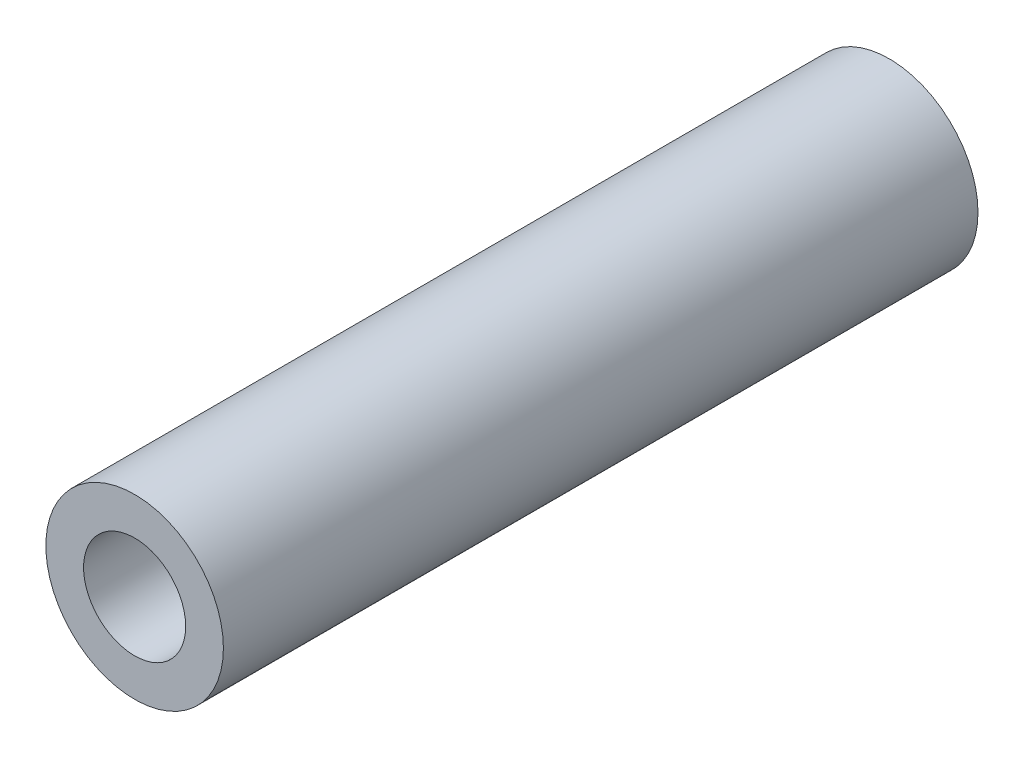
ISO-10303-21;
HEADER;
FILE_DESCRIPTION(('STEP AP214'),'2;1');
FILE_NAME('part.step','',(''),(''),'','','');
FILE_SCHEMA(('AUTOMOTIVE_DESIGN { 1 0 10303 214 1 1 1 1 }'));
ENDSEC;
DATA;
#1=APPLICATION_CONTEXT('core data for automotive mechanical design processes');
#2=APPLICATION_PROTOCOL_DEFINITION('international standard','automotive_design',2000,#1);
#3=PRODUCT_CONTEXT('',#1,'mechanical');
#4=PRODUCT('Part','Part','',(#3));
#5=PRODUCT_RELATED_PRODUCT_CATEGORY('part','',(#4));
#6=PRODUCT_DEFINITION_FORMATION('','',#4);
#7=PRODUCT_DEFINITION_CONTEXT('part definition',#1,'design');
#8=PRODUCT_DEFINITION('design','',#6,#7);
#9=PRODUCT_DEFINITION_SHAPE('','',#8);
#10=(LENGTH_UNIT() NAMED_UNIT(*) SI_UNIT(.MILLI.,.METRE.));
#11=(NAMED_UNIT(*) PLANE_ANGLE_UNIT() SI_UNIT($,.RADIAN.));
#12=(NAMED_UNIT(*) SI_UNIT($,.STERADIAN.) SOLID_ANGLE_UNIT());
#13=UNCERTAINTY_MEASURE_WITH_UNIT(LENGTH_MEASURE(1.E-05),#10,'distance_accuracy_value','');
#14=(GEOMETRIC_REPRESENTATION_CONTEXT(3) GLOBAL_UNCERTAINTY_ASSIGNED_CONTEXT((#13)) GLOBAL_UNIT_ASSIGNED_CONTEXT((#10,
#11,#12)) REPRESENTATION_CONTEXT('',''));
#15=CARTESIAN_POINT('',(0.,0.,0.));
#16=DIRECTION('',(0.,0.,1.));
#17=DIRECTION('',(1.,0.,0.));
#18=AXIS2_PLACEMENT_3D('',#15,#16,#17);
#19=CARTESIAN_POINT('',(0.,0.,17.));
#20=DIRECTION('',(0.,0.,1.));
#21=DIRECTION('',(1.,0.,0.));
#22=AXIS2_PLACEMENT_3D('',#19,#20,#21);
#23=PLANE('',#22);
#24=CARTESIAN_POINT('',(0.,0.,17.));
#25=DIRECTION('',(0.,0.,1.));
#26=DIRECTION('',(1.,0.,0.));
#27=AXIS2_PLACEMENT_3D('',#24,#25,#26);
#28=CIRCLE('',#27,4.);
#29=CARTESIAN_POINT('',(4.,0.,17.));
#30=VERTEX_POINT('',#29);
#31=EDGE_CURVE('E10',#30,#30,#28,.T.);
#32=ORIENTED_EDGE('',*,*,#31,.T.);
#33=EDGE_LOOP('',(#32));
#34=FACE_BOUND('',#33,.T.);
#35=CARTESIAN_POINT('',(0.,0.,17.));
#36=DIRECTION('',(0.,0.,1.));
#37=DIRECTION('',(1.,0.,0.));
#38=AXIS2_PLACEMENT_3D('',#35,#36,#37);
#39=CIRCLE('',#38,2.3);
#40=CARTESIAN_POINT('',(2.3,0.,17.));
#41=VERTEX_POINT('',#40);
#42=EDGE_CURVE('E41',#41,#41,#39,.T.);
#43=ORIENTED_EDGE('',*,*,#42,.F.);
#44=EDGE_LOOP('',(#43));
#45=FACE_BOUND('',#44,.T.);
#46=ADVANCED_FACE('F30',(#34,#45),#23,.T.);
#47=CARTESIAN_POINT('',(0.,0.,-17.));
#48=DIRECTION('',(0.,0.,1.));
#49=DIRECTION('',(1.,0.,0.));
#50=AXIS2_PLACEMENT_3D('',#47,#48,#49);
#51=PLANE('',#50);
#52=CARTESIAN_POINT('',(0.,0.,-17.));
#53=DIRECTION('',(0.,0.,1.));
#54=DIRECTION('',(1.,0.,0.));
#55=AXIS2_PLACEMENT_3D('',#52,#53,#54);
#56=CIRCLE('',#55,4.);
#57=CARTESIAN_POINT('',(4.,0.,-17.));
#58=VERTEX_POINT('',#57);
#59=EDGE_CURVE('E34',#58,#58,#56,.T.);
#60=ORIENTED_EDGE('',*,*,#59,.F.);
#61=EDGE_LOOP('',(#60));
#62=FACE_BOUND('',#61,.T.);
#63=CARTESIAN_POINT('',(0.,0.,-17.));
#64=DIRECTION('',(0.,0.,1.));
#65=DIRECTION('',(1.,0.,0.));
#66=AXIS2_PLACEMENT_3D('',#63,#64,#65);
#67=CIRCLE('',#66,2.3);
#68=CARTESIAN_POINT('',(2.3,0.,-17.));
#69=VERTEX_POINT('',#68);
#70=EDGE_CURVE('E43',#69,#69,#67,.T.);
#71=ORIENTED_EDGE('',*,*,#70,.T.);
#72=EDGE_LOOP('',(#71));
#73=FACE_BOUND('',#72,.T.);
#74=ADVANCED_FACE('F53',(#62,#73),#51,.F.);
#75=CARTESIAN_POINT('',(0.,0.,17.));
#76=DIRECTION('',(0.,0.,-1.));
#77=DIRECTION('',(-1.,0.,0.));
#78=AXIS2_PLACEMENT_3D('',#75,#76,#77);
#79=CYLINDRICAL_SURFACE('',#78,4.);
#80=ORIENTED_EDGE('',*,*,#31,.F.);
#81=EDGE_LOOP('',(#80));
#82=FACE_BOUND('',#81,.T.);
#83=ORIENTED_EDGE('',*,*,#59,.T.);
#84=EDGE_LOOP('',(#83));
#85=FACE_BOUND('',#84,.T.);
#86=ADVANCED_FACE('F32',(#82,#85),#79,.T.);
#87=CARTESIAN_POINT('',(0.,0.,17.));
#88=DIRECTION('',(0.,0.,-1.));
#89=DIRECTION('',(-1.,0.,0.));
#90=AXIS2_PLACEMENT_3D('',#87,#88,#89);
#91=CYLINDRICAL_SURFACE('',#90,2.3);
#92=ORIENTED_EDGE('',*,*,#42,.T.);
#93=EDGE_LOOP('',(#92));
#94=FACE_BOUND('',#93,.T.);
#95=ORIENTED_EDGE('',*,*,#70,.F.);
#96=EDGE_LOOP('',(#95));
#97=FACE_BOUND('',#96,.T.);
#98=ADVANCED_FACE('F49',(#94,#97),#91,.F.);
#99=CLOSED_SHELL('',(#46,#74,#86,#98));
#100=MANIFOLD_SOLID_BREP('B2',#99);
#101=ADVANCED_BREP_SHAPE_REPRESENTATION('',(#18,#100),#14);
#102=SHAPE_DEFINITION_REPRESENTATION(#9,#101);
ENDSEC;
END-ISO-10303-21;
